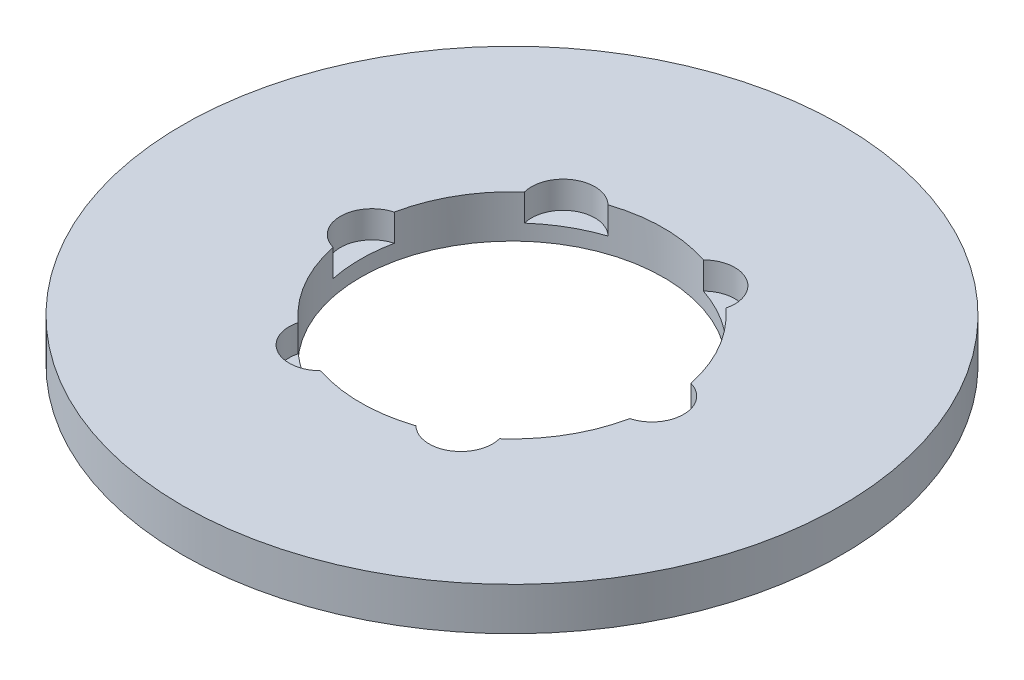
ISO-10303-21;
HEADER;
FILE_DESCRIPTION(('STEP AP214'),'2;1');
FILE_NAME('part.step','',(''),(''),'','','');
FILE_SCHEMA(('AUTOMOTIVE_DESIGN { 1 0 10303 214 1 1 1 1 }'));
ENDSEC;
DATA;
#1=APPLICATION_CONTEXT('core data for automotive mechanical design processes');
#2=APPLICATION_PROTOCOL_DEFINITION('international standard','automotive_design',2000,#1);
#3=PRODUCT_CONTEXT('',#1,'mechanical');
#4=PRODUCT('Part','Part','',(#3));
#5=PRODUCT_RELATED_PRODUCT_CATEGORY('part','',(#4));
#6=PRODUCT_DEFINITION_FORMATION('','',#4);
#7=PRODUCT_DEFINITION_CONTEXT('part definition',#1,'design');
#8=PRODUCT_DEFINITION('design','',#6,#7);
#9=PRODUCT_DEFINITION_SHAPE('','',#8);
#10=(LENGTH_UNIT() NAMED_UNIT(*) SI_UNIT(.MILLI.,.METRE.));
#11=(NAMED_UNIT(*) PLANE_ANGLE_UNIT() SI_UNIT($,.RADIAN.));
#12=(NAMED_UNIT(*) SI_UNIT($,.STERADIAN.) SOLID_ANGLE_UNIT());
#13=UNCERTAINTY_MEASURE_WITH_UNIT(LENGTH_MEASURE(1.E-05),#10,'distance_accuracy_value','');
#14=(GEOMETRIC_REPRESENTATION_CONTEXT(3) GLOBAL_UNCERTAINTY_ASSIGNED_CONTEXT((#13)) GLOBAL_UNIT_ASSIGNED_CONTEXT((#10,
#11,#12)) REPRESENTATION_CONTEXT('',''));
#15=CARTESIAN_POINT('',(0.,0.,0.));
#16=DIRECTION('',(0.,0.,1.));
#17=DIRECTION('',(1.,0.,0.));
#18=AXIS2_PLACEMENT_3D('',#15,#16,#17);
#19=CARTESIAN_POINT('',(0.,12.,0.));
#20=DIRECTION('',(0.,-1.,0.));
#21=DIRECTION('',(0.,0.,-1.));
#22=AXIS2_PLACEMENT_3D('',#19,#20,#21);
#23=CYLINDRICAL_SURFACE('',#22,92.5);
#24=CARTESIAN_POINT('',(0.,12.,0.));
#25=DIRECTION('',(0.,1.,0.));
#26=DIRECTION('',(0.,0.,1.));
#27=AXIS2_PLACEMENT_3D('',#24,#25,#26);
#28=CIRCLE('',#27,92.5);
#29=CARTESIAN_POINT('',(0.,12.,92.5));
#30=VERTEX_POINT('',#29);
#31=EDGE_CURVE('E162',#30,#30,#28,.T.);
#32=ORIENTED_EDGE('',*,*,#31,.F.);
#33=EDGE_LOOP('',(#32));
#34=FACE_BOUND('',#33,.T.);
#35=CARTESIAN_POINT('',(0.,0.,0.));
#36=DIRECTION('',(0.,1.,0.));
#37=DIRECTION('',(0.,0.,1.));
#38=AXIS2_PLACEMENT_3D('',#35,#36,#37);
#39=CIRCLE('',#38,92.5);
#40=CARTESIAN_POINT('',(0.,0.,92.5));
#41=VERTEX_POINT('',#40);
#42=EDGE_CURVE('E157',#41,#41,#39,.T.);
#43=ORIENTED_EDGE('',*,*,#42,.T.);
#44=EDGE_LOOP('',(#43));
#45=FACE_BOUND('',#44,.T.);
#46=ADVANCED_FACE('F39',(#34,#45),#23,.T.);
#47=CARTESIAN_POINT('',(0.,12.,0.));
#48=DIRECTION('',(0.,1.,0.));
#49=DIRECTION('',(0.,0.,1.));
#50=AXIS2_PLACEMENT_3D('',#47,#48,#49);
#51=PLANE('',#50);
#52=CARTESIAN_POINT('',(-19.6308742234137,12.,-34.0016715519458));
#53=DIRECTION('',(0.,1.,0.));
#54=DIRECTION('',(-0.866025403784433,0.,0.50000000000001));
#55=AXIS2_PLACEMENT_3D('',#52,#53,#54);
#56=CIRCLE('',#55,8.89999986036131);
#57=CARTESIAN_POINT('',(-13.3814187020651,12.,-40.3384138696606));
#58=VERTEX_POINT('',#57);
#59=CARTESIAN_POINT('',(-28.2433818084648,12.,-31.7578554694942));
#60=VERTEX_POINT('',#59);
#61=EDGE_CURVE('E218',#58,#60,#56,.T.);
#62=ORIENTED_EDGE('',*,*,#61,.F.);
#63=CARTESIAN_POINT('',(0.,12.,0.));
#64=DIRECTION('',(0.,1.,0.));
#65=DIRECTION('',(0.,0.,1.));
#66=AXIS2_PLACEMENT_3D('',#63,#64,#65);
#67=CIRCLE('',#66,42.5);
#68=CARTESIAN_POINT('',(13.3814187020642,12.,-40.3384138696608));
#69=VERTEX_POINT('',#68);
#70=EDGE_CURVE('E169',#69,#58,#67,.T.);
#71=ORIENTED_EDGE('',*,*,#70,.F.);
#72=CARTESIAN_POINT('',(19.630874223413,12.,-34.0016715519463));
#73=DIRECTION('',(0.,1.,0.));
#74=DIRECTION('',(-0.866025403784443,0.,-0.499999999999992));
#75=AXIS2_PLACEMENT_3D('',#72,#73,#74);
#76=CIRCLE('',#75,8.89999986036131);
#77=CARTESIAN_POINT('',(28.2433818084641,12.,-31.7578554694948));
#78=VERTEX_POINT('',#77);
#79=EDGE_CURVE('E285',#78,#69,#76,.T.);
#80=ORIENTED_EDGE('',*,*,#79,.F.);
#81=CARTESIAN_POINT('',(41.624800510529,12.,-8.58055840016622));
#82=VERTEX_POINT('',#81);
#83=EDGE_CURVE('E174',#82,#78,#67,.T.);
#84=ORIENTED_EDGE('',*,*,#83,.F.);
#85=CARTESIAN_POINT('',(39.2617484468266,12.,0.));
#86=DIRECTION('',(0.,1.,0.));
#87=DIRECTION('',(0.,0.,-1.));
#88=AXIS2_PLACEMENT_3D('',#85,#86,#87);
#89=CIRCLE('',#88,8.89999986036131);
#90=CARTESIAN_POINT('',(41.624800510529,12.,8.58055840016622));
#91=VERTEX_POINT('',#90);
#92=EDGE_CURVE('E280',#91,#82,#89,.T.);
#93=ORIENTED_EDGE('',*,*,#92,.F.);
#94=CARTESIAN_POINT('',(28.2433818084646,12.,31.7578554694944));
#95=VERTEX_POINT('',#94);
#96=EDGE_CURVE('E164',#95,#91,#67,.T.);
#97=ORIENTED_EDGE('',*,*,#96,.F.);
#98=CARTESIAN_POINT('',(19.6308742234135,12.,34.001671551946));
#99=DIRECTION('',(0.,1.,0.));
#100=DIRECTION('',(0.866025403784436,0.,-0.500000000000004));
#101=AXIS2_PLACEMENT_3D('',#98,#99,#100);
#102=CIRCLE('',#101,8.89999986036131);
#103=CARTESIAN_POINT('',(13.3814187020648,12.,40.3384138696607));
#104=VERTEX_POINT('',#103);
#105=EDGE_CURVE('E269',#104,#95,#102,.T.);
#106=ORIENTED_EDGE('',*,*,#105,.F.);
#107=CARTESIAN_POINT('',(-13.3814187020645,12.,40.3384138696607));
#108=VERTEX_POINT('',#107);
#109=EDGE_CURVE('E149',#108,#104,#67,.T.);
#110=ORIENTED_EDGE('',*,*,#109,.F.);
#111=CARTESIAN_POINT('',(-19.6308742234132,12.,34.0016715519461));
#112=DIRECTION('',(0.,1.,0.));
#113=DIRECTION('',(0.86602540378444,0.,0.499999999999998));
#114=AXIS2_PLACEMENT_3D('',#111,#112,#113);
#115=CIRCLE('',#114,8.89999986036131);
#116=CARTESIAN_POINT('',(-28.2433818084643,12.,31.7578554694946));
#117=VERTEX_POINT('',#116);
#118=EDGE_CURVE('E128',#117,#108,#115,.T.);
#119=ORIENTED_EDGE('',*,*,#118,.F.);
#120=CARTESIAN_POINT('',(-41.624800510529,12.,8.58055840016622));
#121=VERTEX_POINT('',#120);
#122=EDGE_CURVE('E148',#121,#117,#67,.T.);
#123=ORIENTED_EDGE('',*,*,#122,.F.);
#124=CARTESIAN_POINT('',(-39.2617484468266,12.,0.));
#125=DIRECTION('',(0.,1.,0.));
#126=DIRECTION('',(0.,0.,1.));
#127=AXIS2_PLACEMENT_3D('',#124,#125,#126);
#128=CIRCLE('',#127,8.89999986036131);
#129=CARTESIAN_POINT('',(-41.624800510529,12.,-8.58055840016622));
#130=VERTEX_POINT('',#129);
#131=EDGE_CURVE('E179',#130,#121,#128,.T.);
#132=ORIENTED_EDGE('',*,*,#131,.F.);
#133=EDGE_CURVE('E161',#60,#130,#67,.T.);
#134=ORIENTED_EDGE('',*,*,#133,.F.);
#135=EDGE_LOOP('',(#62,#71,#80,#84,#93,#97,#106,#110,#119,#123,#132,#134));
#136=FACE_BOUND('',#135,.T.);
#137=ORIENTED_EDGE('',*,*,#31,.T.);
#138=EDGE_LOOP('',(#137));
#139=FACE_BOUND('',#138,.T.);
#140=ADVANCED_FACE('F141',(#136,#139),#51,.T.);
#141=CARTESIAN_POINT('',(0.,0.,0.));
#142=DIRECTION('',(0.,1.,0.));
#143=DIRECTION('',(0.,0.,1.));
#144=AXIS2_PLACEMENT_3D('',#141,#142,#143);
#145=PLANE('',#144);
#146=CARTESIAN_POINT('',(0.,0.,0.));
#147=DIRECTION('',(0.,1.,0.));
#148=DIRECTION('',(0.,0.,1.));
#149=AXIS2_PLACEMENT_3D('',#146,#147,#148);
#150=CIRCLE('',#149,42.5);
#151=CARTESIAN_POINT('',(0.,0.,42.5));
#152=VERTEX_POINT('',#151);
#153=EDGE_CURVE('E166',#152,#152,#150,.T.);
#154=ORIENTED_EDGE('',*,*,#153,.T.);
#155=EDGE_LOOP('',(#154));
#156=FACE_BOUND('',#155,.T.);
#157=ORIENTED_EDGE('',*,*,#42,.F.);
#158=EDGE_LOOP('',(#157));
#159=FACE_BOUND('',#158,.T.);
#160=ADVANCED_FACE('F234',(#156,#159),#145,.F.);
#161=CARTESIAN_POINT('',(0.,12.,0.));
#162=DIRECTION('',(0.,-1.,0.));
#163=DIRECTION('',(0.,0.,-1.));
#164=AXIS2_PLACEMENT_3D('',#161,#162,#163);
#165=CYLINDRICAL_SURFACE('',#164,42.5);
#166=DIRECTION('',(0.,1.,0.));
#167=VECTOR('',#166,1.);
#168=CARTESIAN_POINT('',(-13.3814187020651,8.20655024774819,-40.3384138696606));
#169=LINE('',#168,#167);
#170=CARTESIAN_POINT('',(-13.3814187020651,4.41310049549638,-40.3384138696606));
#171=VERTEX_POINT('',#170);
#172=EDGE_CURVE('E11',#171,#58,#169,.T.);
#173=ORIENTED_EDGE('',*,*,#172,.F.);
#174=CARTESIAN_POINT('',(0.,4.41310049549638,0.));
#175=DIRECTION('',(0.,1.,0.));
#176=DIRECTION('',(0.,0.,1.));
#177=AXIS2_PLACEMENT_3D('',#174,#175,#176);
#178=CIRCLE('',#177,42.5);
#179=CARTESIAN_POINT('',(-28.2433818084648,4.41310049549638,-31.7578554694942));
#180=VERTEX_POINT('',#179);
#181=EDGE_CURVE('E214',#171,#180,#178,.T.);
#182=ORIENTED_EDGE('',*,*,#181,.T.);
#183=DIRECTION('',(0.,1.,0.));
#184=VECTOR('',#183,1.);
#185=CARTESIAN_POINT('',(-28.2433818084648,8.20655024774819,-31.7578554694942));
#186=LINE('',#185,#184);
#187=EDGE_CURVE('E46',#60,#180,#186,.F.);
#188=ORIENTED_EDGE('',*,*,#187,.F.);
#189=ORIENTED_EDGE('',*,*,#133,.T.);
#190=DIRECTION('',(0.,1.,0.));
#191=VECTOR('',#190,1.);
#192=CARTESIAN_POINT('',(-41.624800510529,8.20655024774819,-8.58055840016622));
#193=LINE('',#192,#191);
#194=CARTESIAN_POINT('',(-41.624800510529,4.41310049549638,-8.58055840016622));
#195=VERTEX_POINT('',#194);
#196=EDGE_CURVE('E187',#195,#130,#193,.T.);
#197=ORIENTED_EDGE('',*,*,#196,.F.);
#198=CARTESIAN_POINT('',(0.,4.41310049549638,0.));
#199=DIRECTION('',(0.,1.,0.));
#200=DIRECTION('',(0.,0.,1.));
#201=AXIS2_PLACEMENT_3D('',#198,#199,#200);
#202=CIRCLE('',#201,42.5);
#203=CARTESIAN_POINT('',(-41.624800510529,4.41310049549638,8.58055840016622));
#204=VERTEX_POINT('',#203);
#205=EDGE_CURVE('E184',#195,#204,#202,.T.);
#206=ORIENTED_EDGE('',*,*,#205,.T.);
#207=DIRECTION('',(0.,1.,0.));
#208=VECTOR('',#207,1.);
#209=CARTESIAN_POINT('',(-41.624800510529,8.20655024774819,8.58055840016622));
#210=LINE('',#209,#208);
#211=EDGE_CURVE('E158',#121,#204,#210,.F.);
#212=ORIENTED_EDGE('',*,*,#211,.F.);
#213=ORIENTED_EDGE('',*,*,#122,.T.);
#214=DIRECTION('',(0.,1.,0.));
#215=VECTOR('',#214,1.);
#216=CARTESIAN_POINT('',(-28.2433818084643,8.20655024774819,31.7578554694946));
#217=LINE('',#216,#215);
#218=CARTESIAN_POINT('',(-28.2433818084643,4.41310049549638,31.7578554694946));
#219=VERTEX_POINT('',#218);
#220=EDGE_CURVE('E127',#219,#117,#217,.T.);
#221=ORIENTED_EDGE('',*,*,#220,.F.);
#222=CARTESIAN_POINT('',(0.,4.41310049549638,0.));
#223=DIRECTION('',(0.,1.,0.));
#224=DIRECTION('',(0.,0.,1.));
#225=AXIS2_PLACEMENT_3D('',#222,#223,#224);
#226=CIRCLE('',#225,42.5);
#227=CARTESIAN_POINT('',(-13.3814187020645,4.41310049549638,40.3384138696607));
#228=VERTEX_POINT('',#227);
#229=EDGE_CURVE('E189',#219,#228,#226,.T.);
#230=ORIENTED_EDGE('',*,*,#229,.T.);
#231=DIRECTION('',(0.,1.,0.));
#232=VECTOR('',#231,1.);
#233=CARTESIAN_POINT('',(-13.3814187020645,8.20655024774819,40.3384138696607));
#234=LINE('',#233,#232);
#235=EDGE_CURVE('E140',#108,#228,#234,.F.);
#236=ORIENTED_EDGE('',*,*,#235,.F.);
#237=ORIENTED_EDGE('',*,*,#109,.T.);
#238=DIRECTION('',(0.,1.,0.));
#239=VECTOR('',#238,1.);
#240=CARTESIAN_POINT('',(13.3814187020648,8.20655024774819,40.3384138696607));
#241=LINE('',#240,#239);
#242=CARTESIAN_POINT('',(13.3814187020648,4.41310049549638,40.3384138696607));
#243=VERTEX_POINT('',#242);
#244=EDGE_CURVE('E196',#243,#104,#241,.T.);
#245=ORIENTED_EDGE('',*,*,#244,.F.);
#246=CARTESIAN_POINT('',(0.,4.41310049549638,0.));
#247=DIRECTION('',(0.,1.,0.));
#248=DIRECTION('',(0.,0.,1.));
#249=AXIS2_PLACEMENT_3D('',#246,#247,#248);
#250=CIRCLE('',#249,42.5);
#251=CARTESIAN_POINT('',(28.2433818084646,4.41310049549638,31.7578554694944));
#252=VERTEX_POINT('',#251);
#253=EDGE_CURVE('E136',#243,#252,#250,.T.);
#254=ORIENTED_EDGE('',*,*,#253,.T.);
#255=DIRECTION('',(0.,1.,0.));
#256=VECTOR('',#255,1.);
#257=CARTESIAN_POINT('',(28.2433818084646,8.20655024774819,31.7578554694944));
#258=LINE('',#257,#256);
#259=EDGE_CURVE('E194',#95,#252,#258,.F.);
#260=ORIENTED_EDGE('',*,*,#259,.F.);
#261=ORIENTED_EDGE('',*,*,#96,.T.);
#262=DIRECTION('',(0.,1.,0.));
#263=VECTOR('',#262,1.);
#264=CARTESIAN_POINT('',(41.624800510529,8.20655024774819,8.58055840016622));
#265=LINE('',#264,#263);
#266=CARTESIAN_POINT('',(41.624800510529,4.41310049549638,8.58055840016622));
#267=VERTEX_POINT('',#266);
#268=EDGE_CURVE('E206',#267,#91,#265,.T.);
#269=ORIENTED_EDGE('',*,*,#268,.F.);
#270=CARTESIAN_POINT('',(0.,4.41310049549638,0.));
#271=DIRECTION('',(0.,1.,0.));
#272=DIRECTION('',(0.,0.,1.));
#273=AXIS2_PLACEMENT_3D('',#270,#271,#272);
#274=CIRCLE('',#273,42.5);
#275=CARTESIAN_POINT('',(41.624800510529,4.41310049549638,-8.58055840016622));
#276=VERTEX_POINT('',#275);
#277=EDGE_CURVE('E199',#267,#276,#274,.T.);
#278=ORIENTED_EDGE('',*,*,#277,.T.);
#279=DIRECTION('',(0.,1.,0.));
#280=VECTOR('',#279,1.);
#281=CARTESIAN_POINT('',(41.624800510529,8.20655024774819,-8.58055840016622));
#282=LINE('',#281,#280);
#283=EDGE_CURVE('E201',#82,#276,#282,.F.);
#284=ORIENTED_EDGE('',*,*,#283,.F.);
#285=ORIENTED_EDGE('',*,*,#83,.T.);
#286=DIRECTION('',(0.,1.,0.));
#287=VECTOR('',#286,1.);
#288=CARTESIAN_POINT('',(28.2433818084641,8.20655024774819,-31.7578554694947));
#289=LINE('',#288,#287);
#290=CARTESIAN_POINT('',(28.2433818084641,4.41310049549638,-31.7578554694948));
#291=VERTEX_POINT('',#290);
#292=EDGE_CURVE('E213',#291,#78,#289,.T.);
#293=ORIENTED_EDGE('',*,*,#292,.F.);
#294=CARTESIAN_POINT('',(0.,4.41310049549638,0.));
#295=DIRECTION('',(0.,1.,0.));
#296=DIRECTION('',(0.,0.,1.));
#297=AXIS2_PLACEMENT_3D('',#294,#295,#296);
#298=CIRCLE('',#297,42.5);
#299=CARTESIAN_POINT('',(13.3814187020642,4.41310049549638,-40.3384138696608));
#300=VERTEX_POINT('',#299);
#301=EDGE_CURVE('E208',#291,#300,#298,.T.);
#302=ORIENTED_EDGE('',*,*,#301,.T.);
#303=DIRECTION('',(0.,1.,0.));
#304=VECTOR('',#303,1.);
#305=CARTESIAN_POINT('',(13.3814187020642,8.20655024774819,-40.3384138696608));
#306=LINE('',#305,#304);
#307=EDGE_CURVE('E211',#69,#300,#306,.F.);
#308=ORIENTED_EDGE('',*,*,#307,.F.);
#309=ORIENTED_EDGE('',*,*,#70,.T.);
#310=EDGE_LOOP('',(#173,#182,#188,#189,#197,#206,#212,#213,#221,#230,#236,#237,#245,#254,#260,
#261,#269,#278,#284,#285,#293,#302,#308,#309));
#311=FACE_BOUND('',#310,.T.);
#312=ORIENTED_EDGE('',*,*,#153,.F.);
#313=EDGE_LOOP('',(#312));
#314=FACE_BOUND('',#313,.T.);
#315=ADVANCED_FACE('F152',(#311,#314),#165,.F.);
#316=CARTESIAN_POINT('',(-39.2617484468266,4.41310049549638,0.));
#317=DIRECTION('',(0.,1.,0.));
#318=DIRECTION('',(0.,0.,1.));
#319=AXIS2_PLACEMENT_3D('',#316,#317,#318);
#320=CYLINDRICAL_SURFACE('',#319,8.89999986036131);
#321=ORIENTED_EDGE('',*,*,#196,.T.);
#322=ORIENTED_EDGE('',*,*,#131,.T.);
#323=ORIENTED_EDGE('',*,*,#211,.T.);
#324=CARTESIAN_POINT('',(-39.2617484468266,4.41310049549638,0.));
#325=DIRECTION('',(0.,1.,0.));
#326=DIRECTION('',(0.,0.,1.));
#327=AXIS2_PLACEMENT_3D('',#324,#325,#326);
#328=CIRCLE('',#327,8.89999986036131);
#329=EDGE_CURVE('E180',#195,#204,#328,.T.);
#330=ORIENTED_EDGE('',*,*,#329,.F.);
#331=EDGE_LOOP('',(#321,#322,#323,#330));
#332=FACE_BOUND('',#331,.T.);
#333=ADVANCED_FACE('F244',(#332),#320,.F.);
#334=CARTESIAN_POINT('',(-39.2617484468266,4.41310049549638,0.));
#335=DIRECTION('',(0.,1.,0.));
#336=DIRECTION('',(0.,0.,1.));
#337=AXIS2_PLACEMENT_3D('',#334,#335,#336);
#338=PLANE('',#337);
#339=ORIENTED_EDGE('',*,*,#329,.T.);
#340=ORIENTED_EDGE('',*,*,#205,.F.);
#341=EDGE_LOOP('',(#339,#340));
#342=FACE_BOUND('',#341,.T.);
#343=ADVANCED_FACE('F248',(#342),#338,.T.);
#344=CARTESIAN_POINT('',(-19.6308742234132,4.41310049549638,34.0016715519461));
#345=DIRECTION('',(0.,1.,0.));
#346=DIRECTION('',(0.,0.,1.));
#347=AXIS2_PLACEMENT_3D('',#344,#345,#346);
#348=CYLINDRICAL_SURFACE('',#347,8.89999986036131);
#349=ORIENTED_EDGE('',*,*,#220,.T.);
#350=ORIENTED_EDGE('',*,*,#118,.T.);
#351=ORIENTED_EDGE('',*,*,#235,.T.);
#352=CARTESIAN_POINT('',(-19.6308742234132,4.41310049549638,34.0016715519461));
#353=DIRECTION('',(0.,1.,0.));
#354=DIRECTION('',(0.86602540378444,0.,0.499999999999998));
#355=AXIS2_PLACEMENT_3D('',#352,#353,#354);
#356=CIRCLE('',#355,8.89999986036131);
#357=EDGE_CURVE('E135',#219,#228,#356,.T.);
#358=ORIENTED_EDGE('',*,*,#357,.F.);
#359=EDGE_LOOP('',(#349,#350,#351,#358));
#360=FACE_BOUND('',#359,.T.);
#361=ADVANCED_FACE('F126',(#360),#348,.F.);
#362=CARTESIAN_POINT('',(-19.6308742234132,4.41310049549638,34.0016715519461));
#363=DIRECTION('',(0.,1.,0.));
#364=DIRECTION('',(0.86602540378444,0.,0.499999999999998));
#365=AXIS2_PLACEMENT_3D('',#362,#363,#364);
#366=PLANE('',#365);
#367=ORIENTED_EDGE('',*,*,#357,.T.);
#368=ORIENTED_EDGE('',*,*,#229,.F.);
#369=EDGE_LOOP('',(#367,#368));
#370=FACE_BOUND('',#369,.T.);
#371=ADVANCED_FACE('F258',(#370),#366,.T.);
#372=CARTESIAN_POINT('',(19.6308742234135,4.41310049549638,34.001671551946));
#373=DIRECTION('',(0.,1.,0.));
#374=DIRECTION('',(0.,0.,1.));
#375=AXIS2_PLACEMENT_3D('',#372,#373,#374);
#376=CYLINDRICAL_SURFACE('',#375,8.89999986036131);
#377=ORIENTED_EDGE('',*,*,#244,.T.);
#378=ORIENTED_EDGE('',*,*,#105,.T.);
#379=ORIENTED_EDGE('',*,*,#259,.T.);
#380=CARTESIAN_POINT('',(19.6308742234135,4.41310049549638,34.001671551946));
#381=DIRECTION('',(0.,1.,0.));
#382=DIRECTION('',(0.866025403784436,0.,-0.500000000000004));
#383=AXIS2_PLACEMENT_3D('',#380,#381,#382);
#384=CIRCLE('',#383,8.89999986036131);
#385=EDGE_CURVE('E147',#243,#252,#384,.T.);
#386=ORIENTED_EDGE('',*,*,#385,.F.);
#387=EDGE_LOOP('',(#377,#378,#379,#386));
#388=FACE_BOUND('',#387,.T.);
#389=ADVANCED_FACE('F256',(#388),#376,.F.);
#390=CARTESIAN_POINT('',(19.6308742234135,4.41310049549638,34.001671551946));
#391=DIRECTION('',(0.,1.,0.));
#392=DIRECTION('',(0.866025403784436,0.,-0.500000000000004));
#393=AXIS2_PLACEMENT_3D('',#390,#391,#392);
#394=PLANE('',#393);
#395=ORIENTED_EDGE('',*,*,#385,.T.);
#396=ORIENTED_EDGE('',*,*,#253,.F.);
#397=EDGE_LOOP('',(#395,#396));
#398=FACE_BOUND('',#397,.T.);
#399=ADVANCED_FACE('F263',(#398),#394,.T.);
#400=CARTESIAN_POINT('',(39.2617484468266,4.41310049549638,0.));
#401=DIRECTION('',(0.,1.,0.));
#402=DIRECTION('',(0.,0.,1.));
#403=AXIS2_PLACEMENT_3D('',#400,#401,#402);
#404=CYLINDRICAL_SURFACE('',#403,8.89999986036131);
#405=ORIENTED_EDGE('',*,*,#268,.T.);
#406=ORIENTED_EDGE('',*,*,#92,.T.);
#407=ORIENTED_EDGE('',*,*,#283,.T.);
#408=CARTESIAN_POINT('',(39.2617484468266,4.41310049549638,0.));
#409=DIRECTION('',(0.,1.,0.));
#410=DIRECTION('',(0.,0.,-1.));
#411=AXIS2_PLACEMENT_3D('',#408,#409,#410);
#412=CIRCLE('',#411,8.89999986036131);
#413=EDGE_CURVE('E273',#267,#276,#412,.T.);
#414=ORIENTED_EDGE('',*,*,#413,.F.);
#415=EDGE_LOOP('',(#405,#406,#407,#414));
#416=FACE_BOUND('',#415,.T.);
#417=ADVANCED_FACE('F297',(#416),#404,.F.);
#418=CARTESIAN_POINT('',(39.2617484468266,4.41310049549638,0.));
#419=DIRECTION('',(0.,1.,0.));
#420=DIRECTION('',(0.,0.,-1.));
#421=AXIS2_PLACEMENT_3D('',#418,#419,#420);
#422=PLANE('',#421);
#423=ORIENTED_EDGE('',*,*,#413,.T.);
#424=ORIENTED_EDGE('',*,*,#277,.F.);
#425=EDGE_LOOP('',(#423,#424));
#426=FACE_BOUND('',#425,.T.);
#427=ADVANCED_FACE('F299',(#426),#422,.T.);
#428=CARTESIAN_POINT('',(19.630874223413,4.41310049549638,-34.0016715519463));
#429=DIRECTION('',(0.,1.,0.));
#430=DIRECTION('',(0.,0.,1.));
#431=AXIS2_PLACEMENT_3D('',#428,#429,#430);
#432=CYLINDRICAL_SURFACE('',#431,8.89999986036131);
#433=ORIENTED_EDGE('',*,*,#292,.T.);
#434=ORIENTED_EDGE('',*,*,#79,.T.);
#435=ORIENTED_EDGE('',*,*,#307,.T.);
#436=CARTESIAN_POINT('',(19.630874223413,4.41310049549638,-34.0016715519463));
#437=DIRECTION('',(0.,1.,0.));
#438=DIRECTION('',(-0.866025403784443,0.,-0.499999999999992));
#439=AXIS2_PLACEMENT_3D('',#436,#437,#438);
#440=CIRCLE('',#439,8.89999986036131);
#441=EDGE_CURVE('E56',#291,#300,#440,.T.);
#442=ORIENTED_EDGE('',*,*,#441,.F.);
#443=EDGE_LOOP('',(#433,#434,#435,#442));
#444=FACE_BOUND('',#443,.T.);
#445=ADVANCED_FACE('F292',(#444),#432,.F.);
#446=CARTESIAN_POINT('',(19.630874223413,4.41310049549638,-34.0016715519463));
#447=DIRECTION('',(0.,1.,0.));
#448=DIRECTION('',(-0.866025403784443,0.,-0.499999999999992));
#449=AXIS2_PLACEMENT_3D('',#446,#447,#448);
#450=PLANE('',#449);
#451=ORIENTED_EDGE('',*,*,#441,.T.);
#452=ORIENTED_EDGE('',*,*,#301,.F.);
#453=EDGE_LOOP('',(#451,#452));
#454=FACE_BOUND('',#453,.T.);
#455=ADVANCED_FACE('F226',(#454),#450,.T.);
#456=CARTESIAN_POINT('',(-19.6308742234137,4.41310049549638,-34.0016715519458));
#457=DIRECTION('',(0.,1.,0.));
#458=DIRECTION('',(0.,0.,1.));
#459=AXIS2_PLACEMENT_3D('',#456,#457,#458);
#460=CYLINDRICAL_SURFACE('',#459,8.89999986036131);
#461=ORIENTED_EDGE('',*,*,#172,.T.);
#462=ORIENTED_EDGE('',*,*,#61,.T.);
#463=ORIENTED_EDGE('',*,*,#187,.T.);
#464=CARTESIAN_POINT('',(-19.6308742234137,4.41310049549638,-34.0016715519458));
#465=DIRECTION('',(0.,1.,0.));
#466=DIRECTION('',(-0.866025403784433,0.,0.50000000000001));
#467=AXIS2_PLACEMENT_3D('',#464,#465,#466);
#468=CIRCLE('',#467,8.89999986036131);
#469=EDGE_CURVE('E55',#171,#180,#468,.T.);
#470=ORIENTED_EDGE('',*,*,#469,.F.);
#471=EDGE_LOOP('',(#461,#462,#463,#470));
#472=FACE_BOUND('',#471,.T.);
#473=ADVANCED_FACE('F217',(#472),#460,.F.);
#474=CARTESIAN_POINT('',(-19.6308742234137,4.41310049549638,-34.0016715519458));
#475=DIRECTION('',(0.,1.,0.));
#476=DIRECTION('',(-0.866025403784433,0.,0.50000000000001));
#477=AXIS2_PLACEMENT_3D('',#474,#475,#476);
#478=PLANE('',#477);
#479=ORIENTED_EDGE('',*,*,#469,.T.);
#480=ORIENTED_EDGE('',*,*,#181,.F.);
#481=EDGE_LOOP('',(#479,#480));
#482=FACE_BOUND('',#481,.T.);
#483=ADVANCED_FACE('F219',(#482),#478,.T.);
#484=CLOSED_SHELL('',(#46,#140,#160,#315,#333,#343,#361,#371,#389,#399,#417,#427,#445,#455,#473,#483));
#485=MANIFOLD_SOLID_BREP('B2',#484);
#486=ADVANCED_BREP_SHAPE_REPRESENTATION('',(#18,#485),#14);
#487=SHAPE_DEFINITION_REPRESENTATION(#9,#486);
ENDSEC;
END-ISO-10303-21;
